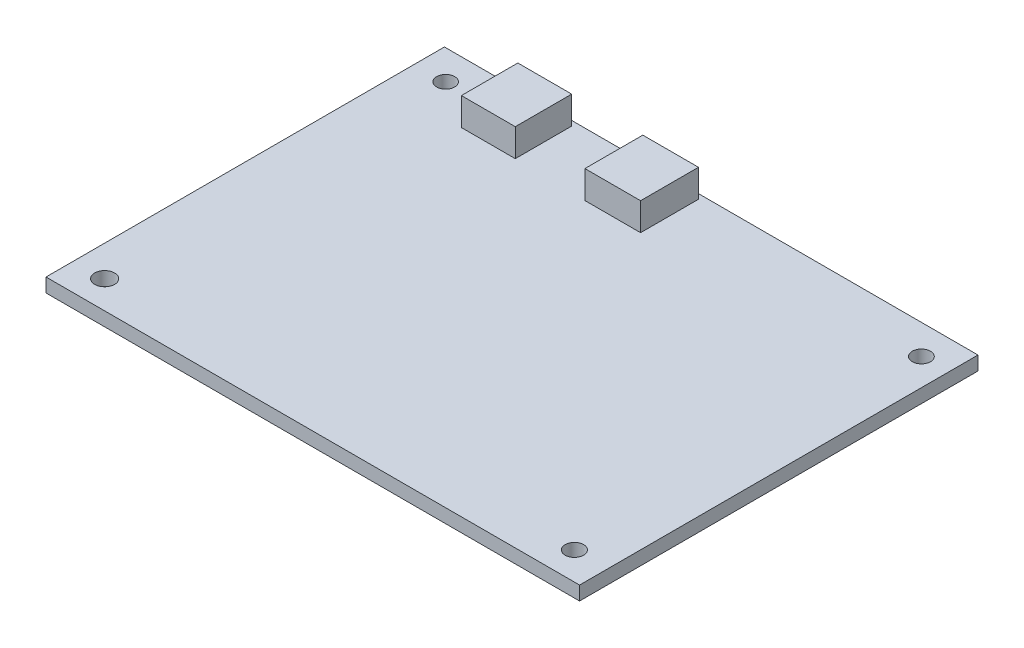
ISO-10303-21;
HEADER;
FILE_DESCRIPTION(('STEP AP214'),'2;1');
FILE_NAME('part.step','',(''),(''),'','','');
FILE_SCHEMA(('AUTOMOTIVE_DESIGN { 1 0 10303 214 1 1 1 1 }'));
ENDSEC;
DATA;
#1=APPLICATION_CONTEXT('core data for automotive mechanical design processes');
#2=APPLICATION_PROTOCOL_DEFINITION('international standard','automotive_design',2000,#1);
#3=PRODUCT_CONTEXT('',#1,'mechanical');
#4=PRODUCT('Part','Part','',(#3));
#5=PRODUCT_RELATED_PRODUCT_CATEGORY('part','',(#4));
#6=PRODUCT_DEFINITION_FORMATION('','',#4);
#7=PRODUCT_DEFINITION_CONTEXT('part definition',#1,'design');
#8=PRODUCT_DEFINITION('design','',#6,#7);
#9=PRODUCT_DEFINITION_SHAPE('','',#8);
#10=(LENGTH_UNIT() NAMED_UNIT(*) SI_UNIT(.MILLI.,.METRE.));
#11=(NAMED_UNIT(*) PLANE_ANGLE_UNIT() SI_UNIT($,.RADIAN.));
#12=(NAMED_UNIT(*) SI_UNIT($,.STERADIAN.) SOLID_ANGLE_UNIT());
#13=UNCERTAINTY_MEASURE_WITH_UNIT(LENGTH_MEASURE(1.E-05),#10,'distance_accuracy_value','');
#14=(GEOMETRIC_REPRESENTATION_CONTEXT(3) GLOBAL_UNCERTAINTY_ASSIGNED_CONTEXT((#13)) GLOBAL_UNIT_ASSIGNED_CONTEXT((#10,
#11,#12)) REPRESENTATION_CONTEXT('',''));
#15=CARTESIAN_POINT('',(0.,0.,0.));
#16=DIRECTION('',(0.,0.,1.));
#17=DIRECTION('',(1.,0.,0.));
#18=AXIS2_PLACEMENT_3D('',#15,#16,#17);
#19=CARTESIAN_POINT('',(0.,2.,0.));
#20=DIRECTION('',(0.,-1.,0.));
#21=DIRECTION('',(0.,0.,-1.));
#22=AXIS2_PLACEMENT_3D('',#19,#20,#21);
#23=PLANE('',#22);
#24=CARTESIAN_POINT('',(34.5985096110648,2.,-24.4852307497467));
#25=DIRECTION('',(0.,1.,0.));
#26=DIRECTION('',(0.,0.,1.));
#27=AXIS2_PLACEMENT_3D('',#24,#25,#26);
#28=CIRCLE('',#27,1.31603448397785);
#29=CARTESIAN_POINT('',(34.5985096110648,2.,-23.1691962657689));
#30=VERTEX_POINT('',#29);
#31=EDGE_CURVE('E631',#30,#30,#28,.T.);
#32=ORIENTED_EDGE('',*,*,#31,.F.);
#33=EDGE_LOOP('',(#32));
#34=FACE_BOUND('',#33,.T.);
#35=CARTESIAN_POINT('',(-34.0582048127804,2.,24.7293266762654));
#36=DIRECTION('',(0.,1.,0.));
#37=DIRECTION('',(0.,0.,1.));
#38=AXIS2_PLACEMENT_3D('',#35,#36,#37);
#39=CIRCLE('',#38,1.43645957947402);
#40=CARTESIAN_POINT('',(-34.0582048127804,2.,26.1657862557394));
#41=VERTEX_POINT('',#40);
#42=EDGE_CURVE('E637',#41,#41,#39,.T.);
#43=ORIENTED_EDGE('',*,*,#42,.F.);
#44=EDGE_LOOP('',(#43));
#45=FACE_BOUND('',#44,.T.);
#46=CARTESIAN_POINT('',(-34.0582048127804,2.,-24.4852307497467));
#47=DIRECTION('',(0.,1.,0.));
#48=DIRECTION('',(0.,0.,1.));
#49=AXIS2_PLACEMENT_3D('',#46,#47,#48);
#50=CIRCLE('',#49,1.3029468687975);
#51=CARTESIAN_POINT('',(-34.0582048127804,2.,-23.1822838809492));
#52=VERTEX_POINT('',#51);
#53=EDGE_CURVE('E695',#52,#52,#50,.T.);
#54=ORIENTED_EDGE('',*,*,#53,.F.);
#55=EDGE_LOOP('',(#54));
#56=FACE_BOUND('',#55,.T.);
#57=CARTESIAN_POINT('',(33.7332280926095,2.,24.7293266762654));
#58=DIRECTION('',(0.,1.,0.));
#59=DIRECTION('',(0.,0.,1.));
#60=AXIS2_PLACEMENT_3D('',#57,#58,#59);
#61=CIRCLE('',#60,1.33131580240961);
#62=CARTESIAN_POINT('',(33.7332280926095,2.,26.060642478675));
#63=VERTEX_POINT('',#62);
#64=EDGE_CURVE('E634',#63,#63,#61,.T.);
#65=ORIENTED_EDGE('',*,*,#64,.F.);
#66=EDGE_LOOP('',(#65));
#67=FACE_BOUND('',#66,.T.);
#68=DIRECTION('',(0.,0.,1.));
#69=VECTOR('',#68,1.);
#70=CARTESIAN_POINT('',(-27.2016642660136,2.,-28.0419154294975));
#71=LINE('',#70,#69);
#72=CARTESIAN_POINT('',(-27.2016642660136,2.,-28.0419154294975));
#73=VERTEX_POINT('',#72);
#74=CARTESIAN_POINT('',(-27.2016642660136,2.,-19.8983175246301));
#75=VERTEX_POINT('',#74);
#76=EDGE_CURVE('E287',#73,#75,#71,.T.);
#77=ORIENTED_EDGE('',*,*,#76,.F.);
#78=DIRECTION('',(-1.,0.,0.));
#79=VECTOR('',#78,1.);
#80=CARTESIAN_POINT('',(-27.2016642660136,2.,-28.0419154294975));
#81=LINE('',#80,#79);
#82=CARTESIAN_POINT('',(-26.2016642660136,2.,-28.0419154294975));
#83=VERTEX_POINT('',#82);
#84=EDGE_CURVE('E307',#83,#73,#81,.T.);
#85=ORIENTED_EDGE('',*,*,#84,.F.);
#86=CARTESIAN_POINT('',(-20.4260844658487,2.,-28.0419154294975));
#87=VERTEX_POINT('',#86);
#88=EDGE_CURVE('E310',#87,#83,#81,.T.);
#89=ORIENTED_EDGE('',*,*,#88,.F.);
#90=CARTESIAN_POINT('',(-19.4260844658487,2.,-28.0419154294975));
#91=VERTEX_POINT('',#90);
#92=EDGE_CURVE('E292',#91,#87,#81,.T.);
#93=ORIENTED_EDGE('',*,*,#92,.F.);
#94=DIRECTION('',(0.,0.,-1.));
#95=VECTOR('',#94,1.);
#96=CARTESIAN_POINT('',(-19.4260844658487,2.,-28.0419154294975));
#97=LINE('',#96,#95);
#98=CARTESIAN_POINT('',(-19.4260844658487,2.,-19.8983175246301));
#99=VERTEX_POINT('',#98);
#100=EDGE_CURVE('E304',#99,#91,#97,.T.);
#101=ORIENTED_EDGE('',*,*,#100,.F.);
#102=DIRECTION('',(1.,0.,0.));
#103=VECTOR('',#102,1.);
#104=CARTESIAN_POINT('',(-27.2016642660136,2.,-19.8983175246301));
#105=LINE('',#104,#103);
#106=EDGE_CURVE('E301',#75,#99,#105,.T.);
#107=ORIENTED_EDGE('',*,*,#106,.F.);
#108=EDGE_LOOP('',(#77,#85,#89,#93,#101,#107));
#109=FACE_BOUND('',#108,.T.);
#110=DIRECTION('',(0.,0.,-1.));
#111=VECTOR('',#110,1.);
#112=CARTESIAN_POINT('',(38.5,2.,28.75));
#113=LINE('',#112,#111);
#114=CARTESIAN_POINT('',(38.5,2.,28.75));
#115=VERTEX_POINT('',#114);
#116=CARTESIAN_POINT('',(38.5,2.,-28.75));
#117=VERTEX_POINT('',#116);
#118=EDGE_CURVE('E323',#115,#117,#113,.T.);
#119=ORIENTED_EDGE('',*,*,#118,.T.);
#120=DIRECTION('',(-1.,0.,0.));
#121=VECTOR('',#120,1.);
#122=CARTESIAN_POINT('',(-38.5,2.,-28.75));
#123=LINE('',#122,#121);
#124=CARTESIAN_POINT('',(-38.5,2.,-28.75));
#125=VERTEX_POINT('',#124);
#126=EDGE_CURVE('E326',#117,#125,#123,.T.);
#127=ORIENTED_EDGE('',*,*,#126,.T.);
#128=DIRECTION('',(0.,0.,1.));
#129=VECTOR('',#128,1.);
#130=CARTESIAN_POINT('',(-38.5,2.,28.75));
#131=LINE('',#130,#129);
#132=CARTESIAN_POINT('',(-38.5,2.,28.75));
#133=VERTEX_POINT('',#132);
#134=EDGE_CURVE('E329',#125,#133,#131,.T.);
#135=ORIENTED_EDGE('',*,*,#134,.T.);
#136=DIRECTION('',(1.,0.,0.));
#137=VECTOR('',#136,1.);
#138=CARTESIAN_POINT('',(-38.5,2.,28.75));
#139=LINE('',#138,#137);
#140=EDGE_CURVE('E331',#133,#115,#139,.T.);
#141=ORIENTED_EDGE('',*,*,#140,.T.);
#142=EDGE_LOOP('',(#119,#127,#135,#141));
#143=FACE_BOUND('',#142,.T.);
#144=DIRECTION('',(0.,0.,1.));
#145=VECTOR('',#144,1.);
#146=CARTESIAN_POINT('',(-9.16586188666458,2.,-28.0453015734762));
#147=LINE('',#146,#145);
#148=CARTESIAN_POINT('',(-9.16586188666458,2.,-28.0453015734762));
#149=VERTEX_POINT('',#148);
#150=CARTESIAN_POINT('',(-9.16586188666457,2.,-19.6883996287313));
#151=VERTEX_POINT('',#150);
#152=EDGE_CURVE('E212',#149,#151,#147,.T.);
#153=ORIENTED_EDGE('',*,*,#152,.F.);
#154=DIRECTION('',(-1.,0.,0.));
#155=VECTOR('',#154,1.);
#156=CARTESIAN_POINT('',(-9.16586188666458,2.,-28.0453015734762));
#157=LINE('',#156,#155);
#158=CARTESIAN_POINT('',(-8.16586188666457,2.,-28.0453015734762));
#159=VERTEX_POINT('',#158);
#160=EDGE_CURVE('E272',#159,#149,#157,.T.);
#161=ORIENTED_EDGE('',*,*,#160,.F.);
#162=CARTESIAN_POINT('',(-2.13398488742122,2.,-28.0453015734762));
#163=VERTEX_POINT('',#162);
#164=EDGE_CURVE('E275',#163,#159,#157,.T.);
#165=ORIENTED_EDGE('',*,*,#164,.F.);
#166=CARTESIAN_POINT('',(-1.13398488742122,2.,-28.0453015734762));
#167=VERTEX_POINT('',#166);
#168=EDGE_CURVE('E257',#167,#163,#157,.T.);
#169=ORIENTED_EDGE('',*,*,#168,.F.);
#170=DIRECTION('',(0.,0.,-1.));
#171=VECTOR('',#170,1.);
#172=CARTESIAN_POINT('',(-1.13398488742122,2.,-28.0453015734762));
#173=LINE('',#172,#171);
#174=CARTESIAN_POINT('',(-1.13398488742122,2.,-19.6883996287313));
#175=VERTEX_POINT('',#174);
#176=EDGE_CURVE('E269',#175,#167,#173,.T.);
#177=ORIENTED_EDGE('',*,*,#176,.F.);
#178=DIRECTION('',(1.,0.,0.));
#179=VECTOR('',#178,1.);
#180=CARTESIAN_POINT('',(-9.16586188666457,2.,-19.6883996287313));
#181=LINE('',#180,#179);
#182=EDGE_CURVE('E266',#151,#175,#181,.T.);
#183=ORIENTED_EDGE('',*,*,#182,.F.);
#184=EDGE_LOOP('',(#153,#161,#165,#169,#177,#183));
#185=FACE_BOUND('',#184,.T.);
#186=ADVANCED_FACE('F33',(#34,#45,#56,#67,#109,#143,#185),#23,.F.);
#187=CARTESIAN_POINT('',(38.5,2.,28.75));
#188=DIRECTION('',(-1.,0.,0.));
#189=DIRECTION('',(0.,0.,1.));
#190=AXIS2_PLACEMENT_3D('',#187,#188,#189);
#191=PLANE('',#190);
#192=DIRECTION('',(0.,0.,-1.));
#193=VECTOR('',#192,1.);
#194=CARTESIAN_POINT('',(38.5,0.,28.75));
#195=LINE('',#194,#193);
#196=CARTESIAN_POINT('',(38.5,0.,28.75));
#197=VERTEX_POINT('',#196);
#198=CARTESIAN_POINT('',(38.5,0.,-28.75));
#199=VERTEX_POINT('',#198);
#200=EDGE_CURVE('E322',#197,#199,#195,.T.);
#201=ORIENTED_EDGE('',*,*,#200,.T.);
#202=DIRECTION('',(0.,-1.,0.));
#203=VECTOR('',#202,1.);
#204=CARTESIAN_POINT('',(38.5,2.,-28.75));
#205=LINE('',#204,#203);
#206=EDGE_CURVE('E11',#117,#199,#205,.T.);
#207=ORIENTED_EDGE('',*,*,#206,.F.);
#208=ORIENTED_EDGE('',*,*,#118,.F.);
#209=DIRECTION('',(0.,-1.,0.));
#210=VECTOR('',#209,1.);
#211=CARTESIAN_POINT('',(38.5,2.,28.75));
#212=LINE('',#211,#210);
#213=EDGE_CURVE('E333',#115,#197,#212,.T.);
#214=ORIENTED_EDGE('',*,*,#213,.T.);
#215=EDGE_LOOP('',(#201,#207,#208,#214));
#216=FACE_BOUND('',#215,.T.);
#217=ADVANCED_FACE('F35',(#216),#191,.F.);
#218=CARTESIAN_POINT('',(-38.5,2.,-28.75));
#219=DIRECTION('',(0.,0.,1.));
#220=DIRECTION('',(1.,0.,0.));
#221=AXIS2_PLACEMENT_3D('',#218,#219,#220);
#222=PLANE('',#221);
#223=DIRECTION('',(-1.,0.,0.));
#224=VECTOR('',#223,1.);
#225=CARTESIAN_POINT('',(-38.5,0.,-28.75));
#226=LINE('',#225,#224);
#227=CARTESIAN_POINT('',(-38.5,0.,-28.75));
#228=VERTEX_POINT('',#227);
#229=EDGE_CURVE('E336',#199,#228,#226,.T.);
#230=ORIENTED_EDGE('',*,*,#229,.T.);
#231=DIRECTION('',(0.,-1.,0.));
#232=VECTOR('',#231,1.);
#233=CARTESIAN_POINT('',(-38.5,2.,-28.75));
#234=LINE('',#233,#232);
#235=EDGE_CURVE('E41',#125,#228,#234,.T.);
#236=ORIENTED_EDGE('',*,*,#235,.F.);
#237=ORIENTED_EDGE('',*,*,#126,.F.);
#238=ORIENTED_EDGE('',*,*,#206,.T.);
#239=EDGE_LOOP('',(#230,#236,#237,#238));
#240=FACE_BOUND('',#239,.T.);
#241=ADVANCED_FACE('F366',(#240),#222,.F.);
#242=CARTESIAN_POINT('',(-38.5,2.,28.75));
#243=DIRECTION('',(1.,0.,0.));
#244=DIRECTION('',(0.,0.,-1.));
#245=AXIS2_PLACEMENT_3D('',#242,#243,#244);
#246=PLANE('',#245);
#247=DIRECTION('',(0.,0.,1.));
#248=VECTOR('',#247,1.);
#249=CARTESIAN_POINT('',(-38.5,0.,28.75));
#250=LINE('',#249,#248);
#251=CARTESIAN_POINT('',(-38.5,0.,28.75));
#252=VERTEX_POINT('',#251);
#253=EDGE_CURVE('E338',#228,#252,#250,.T.);
#254=ORIENTED_EDGE('',*,*,#253,.T.);
#255=DIRECTION('',(0.,-1.,0.));
#256=VECTOR('',#255,1.);
#257=CARTESIAN_POINT('',(-38.5,2.,28.75));
#258=LINE('',#257,#256);
#259=EDGE_CURVE('E343',#133,#252,#258,.T.);
#260=ORIENTED_EDGE('',*,*,#259,.F.);
#261=ORIENTED_EDGE('',*,*,#134,.F.);
#262=ORIENTED_EDGE('',*,*,#235,.T.);
#263=EDGE_LOOP('',(#254,#260,#261,#262));
#264=FACE_BOUND('',#263,.T.);
#265=ADVANCED_FACE('F350',(#264),#246,.F.);
#266=CARTESIAN_POINT('',(-38.5,2.,28.75));
#267=DIRECTION('',(0.,0.,-1.));
#268=DIRECTION('',(-1.,0.,0.));
#269=AXIS2_PLACEMENT_3D('',#266,#267,#268);
#270=PLANE('',#269);
#271=DIRECTION('',(1.,0.,0.));
#272=VECTOR('',#271,1.);
#273=CARTESIAN_POINT('',(-38.5,0.,28.75));
#274=LINE('',#273,#272);
#275=EDGE_CURVE('E327',#252,#197,#274,.T.);
#276=ORIENTED_EDGE('',*,*,#275,.T.);
#277=ORIENTED_EDGE('',*,*,#213,.F.);
#278=ORIENTED_EDGE('',*,*,#140,.F.);
#279=ORIENTED_EDGE('',*,*,#259,.T.);
#280=EDGE_LOOP('',(#276,#277,#278,#279));
#281=FACE_BOUND('',#280,.T.);
#282=ADVANCED_FACE('F359',(#281),#270,.F.);
#283=CARTESIAN_POINT('',(0.,0.,0.));
#284=DIRECTION('',(0.,-1.,0.));
#285=DIRECTION('',(0.,0.,-1.));
#286=AXIS2_PLACEMENT_3D('',#283,#284,#285);
#287=PLANE('',#286);
#288=CARTESIAN_POINT('',(34.5985096110648,0.,-24.4852307497467));
#289=DIRECTION('',(0.,1.,0.));
#290=DIRECTION('',(0.,0.,1.));
#291=AXIS2_PLACEMENT_3D('',#288,#289,#290);
#292=CIRCLE('',#291,1.31603448397785);
#293=CARTESIAN_POINT('',(34.5985096110648,0.,-23.1691962657689));
#294=VERTEX_POINT('',#293);
#295=EDGE_CURVE('E629',#294,#294,#292,.T.);
#296=ORIENTED_EDGE('',*,*,#295,.T.);
#297=EDGE_LOOP('',(#296));
#298=FACE_BOUND('',#297,.T.);
#299=CARTESIAN_POINT('',(-34.0582048127804,0.,24.7293266762654));
#300=DIRECTION('',(0.,1.,0.));
#301=DIRECTION('',(0.,0.,1.));
#302=AXIS2_PLACEMENT_3D('',#299,#300,#301);
#303=CIRCLE('',#302,1.43645957947402);
#304=CARTESIAN_POINT('',(-34.0582048127804,0.,26.1657862557394));
#305=VERTEX_POINT('',#304);
#306=EDGE_CURVE('E632',#305,#305,#303,.T.);
#307=ORIENTED_EDGE('',*,*,#306,.T.);
#308=EDGE_LOOP('',(#307));
#309=FACE_BOUND('',#308,.T.);
#310=CARTESIAN_POINT('',(-34.0582048127804,0.,-24.4852307497467));
#311=DIRECTION('',(0.,1.,0.));
#312=DIRECTION('',(0.,0.,1.));
#313=AXIS2_PLACEMENT_3D('',#310,#311,#312);
#314=CIRCLE('',#313,1.3029468687975);
#315=CARTESIAN_POINT('',(-34.0582048127804,0.,-23.1822838809492));
#316=VERTEX_POINT('',#315);
#317=EDGE_CURVE('E643',#316,#316,#314,.T.);
#318=ORIENTED_EDGE('',*,*,#317,.T.);
#319=EDGE_LOOP('',(#318));
#320=FACE_BOUND('',#319,.T.);
#321=CARTESIAN_POINT('',(33.7332280926095,0.,24.7293266762654));
#322=DIRECTION('',(0.,1.,0.));
#323=DIRECTION('',(0.,0.,1.));
#324=AXIS2_PLACEMENT_3D('',#321,#322,#323);
#325=CIRCLE('',#324,1.33131580240961);
#326=CARTESIAN_POINT('',(33.7332280926095,0.,26.060642478675));
#327=VERTEX_POINT('',#326);
#328=EDGE_CURVE('E644',#327,#327,#325,.T.);
#329=ORIENTED_EDGE('',*,*,#328,.T.);
#330=EDGE_LOOP('',(#329));
#331=FACE_BOUND('',#330,.T.);
#332=ORIENTED_EDGE('',*,*,#200,.F.);
#333=ORIENTED_EDGE('',*,*,#275,.F.);
#334=ORIENTED_EDGE('',*,*,#253,.F.);
#335=ORIENTED_EDGE('',*,*,#229,.F.);
#336=EDGE_LOOP('',(#332,#333,#334,#335));
#337=FACE_BOUND('',#336,.T.);
#338=ADVANCED_FACE('F356',(#298,#309,#320,#331,#337),#287,.T.);
#339=CARTESIAN_POINT('',(-27.2016642660136,6.,-28.0419154294975));
#340=DIRECTION('',(1.,0.,0.));
#341=DIRECTION('',(0.,0.,-1.));
#342=AXIS2_PLACEMENT_3D('',#339,#340,#341);
#343=PLANE('',#342);
#344=ORIENTED_EDGE('',*,*,#76,.T.);
#345=DIRECTION('',(0.,-1.,0.));
#346=VECTOR('',#345,1.);
#347=CARTESIAN_POINT('',(-27.2016642660136,6.,-19.8983175246301));
#348=LINE('',#347,#346);
#349=CARTESIAN_POINT('',(-27.2016642660136,6.,-19.8983175246301));
#350=VERTEX_POINT('',#349);
#351=EDGE_CURVE('E319',#350,#75,#348,.T.);
#352=ORIENTED_EDGE('',*,*,#351,.F.);
#353=DIRECTION('',(0.,0.,1.));
#354=VECTOR('',#353,1.);
#355=CARTESIAN_POINT('',(-27.2016642660136,6.,-28.0419154294975));
#356=LINE('',#355,#354);
#357=CARTESIAN_POINT('',(-27.2016642660136,6.,-28.0419154294975));
#358=VERTEX_POINT('',#357);
#359=EDGE_CURVE('E288',#358,#350,#356,.T.);
#360=ORIENTED_EDGE('',*,*,#359,.F.);
#361=DIRECTION('',(0.,-1.,0.));
#362=VECTOR('',#361,1.);
#363=CARTESIAN_POINT('',(-27.2016642660136,6.,-28.0419154294975));
#364=LINE('',#363,#362);
#365=EDGE_CURVE('E298',#358,#73,#364,.T.);
#366=ORIENTED_EDGE('',*,*,#365,.T.);
#367=EDGE_LOOP('',(#344,#352,#360,#366));
#368=FACE_BOUND('',#367,.T.);
#369=ADVANCED_FACE('F384',(#368),#343,.F.);
#370=CARTESIAN_POINT('',(-27.2016642660136,6.,-19.8983175246301));
#371=DIRECTION('',(0.,0.,-1.));
#372=DIRECTION('',(-1.,0.,0.));
#373=AXIS2_PLACEMENT_3D('',#370,#371,#372);
#374=PLANE('',#373);
#375=ORIENTED_EDGE('',*,*,#106,.T.);
#376=DIRECTION('',(0.,-1.,0.));
#377=VECTOR('',#376,1.);
#378=CARTESIAN_POINT('',(-19.4260844658487,6.,-19.8983175246301));
#379=LINE('',#378,#377);
#380=CARTESIAN_POINT('',(-19.4260844658487,6.,-19.8983175246301));
#381=VERTEX_POINT('',#380);
#382=EDGE_CURVE('E316',#381,#99,#379,.T.);
#383=ORIENTED_EDGE('',*,*,#382,.F.);
#384=DIRECTION('',(1.,0.,0.));
#385=VECTOR('',#384,1.);
#386=CARTESIAN_POINT('',(-27.2016642660136,6.,-19.8983175246301));
#387=LINE('',#386,#385);
#388=EDGE_CURVE('E291',#350,#381,#387,.T.);
#389=ORIENTED_EDGE('',*,*,#388,.F.);
#390=ORIENTED_EDGE('',*,*,#351,.T.);
#391=EDGE_LOOP('',(#375,#383,#389,#390));
#392=FACE_BOUND('',#391,.T.);
#393=ADVANCED_FACE('F431',(#392),#374,.F.);
#394=CARTESIAN_POINT('',(-19.4260844658487,6.,-28.0419154294975));
#395=DIRECTION('',(-1.,0.,0.));
#396=DIRECTION('',(0.,0.,1.));
#397=AXIS2_PLACEMENT_3D('',#394,#395,#396);
#398=PLANE('',#397);
#399=ORIENTED_EDGE('',*,*,#100,.T.);
#400=DIRECTION('',(0.,-1.,0.));
#401=VECTOR('',#400,1.);
#402=CARTESIAN_POINT('',(-19.4260844658487,6.,-28.0419154294975));
#403=LINE('',#402,#401);
#404=CARTESIAN_POINT('',(-19.4260844658487,6.,-28.0419154294975));
#405=VERTEX_POINT('',#404);
#406=EDGE_CURVE('E313',#405,#91,#403,.T.);
#407=ORIENTED_EDGE('',*,*,#406,.F.);
#408=DIRECTION('',(0.,0.,-1.));
#409=VECTOR('',#408,1.);
#410=CARTESIAN_POINT('',(-19.4260844658487,6.,-28.0419154294975));
#411=LINE('',#410,#409);
#412=EDGE_CURVE('E294',#381,#405,#411,.T.);
#413=ORIENTED_EDGE('',*,*,#412,.F.);
#414=ORIENTED_EDGE('',*,*,#382,.T.);
#415=EDGE_LOOP('',(#399,#407,#413,#414));
#416=FACE_BOUND('',#415,.T.);
#417=ADVANCED_FACE('F437',(#416),#398,.F.);
#418=CARTESIAN_POINT('',(-27.2016642660136,6.,-28.0419154294975));
#419=DIRECTION('',(0.,0.,1.));
#420=DIRECTION('',(1.,0.,0.));
#421=AXIS2_PLACEMENT_3D('',#418,#419,#420);
#422=PLANE('',#421);
#423=DIRECTION('',(-1.,0.,0.));
#424=VECTOR('',#423,1.);
#425=CARTESIAN_POINT('',(-27.2016642660136,5.,-28.0419154294975));
#426=LINE('',#425,#424);
#427=CARTESIAN_POINT('',(-20.4260844658487,5.,-28.0419154294975));
#428=VERTEX_POINT('',#427);
#429=CARTESIAN_POINT('',(-26.2016642660136,5.,-28.0419154294975));
#430=VERTEX_POINT('',#429);
#431=EDGE_CURVE('E48',#428,#430,#426,.T.);
#432=ORIENTED_EDGE('',*,*,#431,.T.);
#433=DIRECTION('',(0.,-1.,0.));
#434=VECTOR('',#433,1.);
#435=CARTESIAN_POINT('',(-26.2016642660136,6.,-28.0419154294975));
#436=LINE('',#435,#434);
#437=EDGE_CURVE('E237',#430,#83,#436,.T.);
#438=ORIENTED_EDGE('',*,*,#437,.T.);
#439=ORIENTED_EDGE('',*,*,#84,.T.);
#440=ORIENTED_EDGE('',*,*,#365,.F.);
#441=DIRECTION('',(-1.,0.,0.));
#442=VECTOR('',#441,1.);
#443=CARTESIAN_POINT('',(-27.2016642660136,6.,-28.0419154294975));
#444=LINE('',#443,#442);
#445=EDGE_CURVE('E296',#405,#358,#444,.T.);
#446=ORIENTED_EDGE('',*,*,#445,.F.);
#447=ORIENTED_EDGE('',*,*,#406,.T.);
#448=ORIENTED_EDGE('',*,*,#92,.T.);
#449=DIRECTION('',(0.,-1.,0.));
#450=VECTOR('',#449,1.);
#451=CARTESIAN_POINT('',(-20.4260844658487,6.,-28.0419154294975));
#452=LINE('',#451,#450);
#453=EDGE_CURVE('E210',#428,#87,#452,.T.);
#454=ORIENTED_EDGE('',*,*,#453,.F.);
#455=EDGE_LOOP('',(#432,#438,#439,#440,#446,#447,#448,#454));
#456=FACE_BOUND('',#455,.T.);
#457=ADVANCED_FACE('F444',(#456),#422,.F.);
#458=CARTESIAN_POINT('',(0.,6.,0.));
#459=DIRECTION('',(0.,1.,0.));
#460=DIRECTION('',(0.,0.,1.));
#461=AXIS2_PLACEMENT_3D('',#458,#459,#460);
#462=PLANE('',#461);
#463=ORIENTED_EDGE('',*,*,#359,.T.);
#464=ORIENTED_EDGE('',*,*,#388,.T.);
#465=ORIENTED_EDGE('',*,*,#412,.T.);
#466=ORIENTED_EDGE('',*,*,#445,.T.);
#467=EDGE_LOOP('',(#463,#464,#465,#466));
#468=FACE_BOUND('',#467,.T.);
#469=ADVANCED_FACE('F453',(#468),#462,.T.);
#470=CARTESIAN_POINT('',(-9.16586188666458,6.,-28.0453015734762));
#471=DIRECTION('',(1.,0.,0.));
#472=DIRECTION('',(0.,0.,-1.));
#473=AXIS2_PLACEMENT_3D('',#470,#471,#472);
#474=PLANE('',#473);
#475=ORIENTED_EDGE('',*,*,#152,.T.);
#476=DIRECTION('',(0.,-1.,0.));
#477=VECTOR('',#476,1.);
#478=CARTESIAN_POINT('',(-9.16586188666457,6.,-19.6883996287313));
#479=LINE('',#478,#477);
#480=CARTESIAN_POINT('',(-9.16586188666457,6.,-19.6883996287313));
#481=VERTEX_POINT('',#480);
#482=EDGE_CURVE('E284',#481,#151,#479,.T.);
#483=ORIENTED_EDGE('',*,*,#482,.F.);
#484=DIRECTION('',(0.,0.,1.));
#485=VECTOR('',#484,1.);
#486=CARTESIAN_POINT('',(-9.16586188666458,6.,-28.0453015734762));
#487=LINE('',#486,#485);
#488=CARTESIAN_POINT('',(-9.16586188666458,6.,-28.0453015734762));
#489=VERTEX_POINT('',#488);
#490=EDGE_CURVE('E253',#489,#481,#487,.T.);
#491=ORIENTED_EDGE('',*,*,#490,.F.);
#492=DIRECTION('',(0.,-1.,0.));
#493=VECTOR('',#492,1.);
#494=CARTESIAN_POINT('',(-9.16586188666458,6.,-28.0453015734762));
#495=LINE('',#494,#493);
#496=EDGE_CURVE('E263',#489,#149,#495,.T.);
#497=ORIENTED_EDGE('',*,*,#496,.T.);
#498=EDGE_LOOP('',(#475,#483,#491,#497));
#499=FACE_BOUND('',#498,.T.);
#500=ADVANCED_FACE('F462',(#499),#474,.F.);
#501=CARTESIAN_POINT('',(-9.16586188666457,6.,-19.6883996287313));
#502=DIRECTION('',(0.,0.,-1.));
#503=DIRECTION('',(-1.,0.,0.));
#504=AXIS2_PLACEMENT_3D('',#501,#502,#503);
#505=PLANE('',#504);
#506=ORIENTED_EDGE('',*,*,#182,.T.);
#507=DIRECTION('',(0.,-1.,0.));
#508=VECTOR('',#507,1.);
#509=CARTESIAN_POINT('',(-1.13398488742122,6.,-19.6883996287313));
#510=LINE('',#509,#508);
#511=CARTESIAN_POINT('',(-1.13398488742122,6.,-19.6883996287313));
#512=VERTEX_POINT('',#511);
#513=EDGE_CURVE('E281',#512,#175,#510,.T.);
#514=ORIENTED_EDGE('',*,*,#513,.F.);
#515=DIRECTION('',(1.,0.,0.));
#516=VECTOR('',#515,1.);
#517=CARTESIAN_POINT('',(-9.16586188666457,6.,-19.6883996287313));
#518=LINE('',#517,#516);
#519=EDGE_CURVE('E256',#481,#512,#518,.T.);
#520=ORIENTED_EDGE('',*,*,#519,.F.);
#521=ORIENTED_EDGE('',*,*,#482,.T.);
#522=EDGE_LOOP('',(#506,#514,#520,#521));
#523=FACE_BOUND('',#522,.T.);
#524=ADVANCED_FACE('F470',(#523),#505,.F.);
#525=CARTESIAN_POINT('',(-1.13398488742122,6.,-28.0453015734762));
#526=DIRECTION('',(-1.,0.,0.));
#527=DIRECTION('',(0.,0.,1.));
#528=AXIS2_PLACEMENT_3D('',#525,#526,#527);
#529=PLANE('',#528);
#530=ORIENTED_EDGE('',*,*,#176,.T.);
#531=DIRECTION('',(0.,-1.,0.));
#532=VECTOR('',#531,1.);
#533=CARTESIAN_POINT('',(-1.13398488742122,6.,-28.0453015734762));
#534=LINE('',#533,#532);
#535=CARTESIAN_POINT('',(-1.13398488742122,6.,-28.0453015734762));
#536=VERTEX_POINT('',#535);
#537=EDGE_CURVE('E278',#536,#167,#534,.T.);
#538=ORIENTED_EDGE('',*,*,#537,.F.);
#539=DIRECTION('',(0.,0.,-1.));
#540=VECTOR('',#539,1.);
#541=CARTESIAN_POINT('',(-1.13398488742122,6.,-28.0453015734762));
#542=LINE('',#541,#540);
#543=EDGE_CURVE('E259',#512,#536,#542,.T.);
#544=ORIENTED_EDGE('',*,*,#543,.F.);
#545=ORIENTED_EDGE('',*,*,#513,.T.);
#546=EDGE_LOOP('',(#530,#538,#544,#545));
#547=FACE_BOUND('',#546,.T.);
#548=ADVANCED_FACE('F478',(#547),#529,.F.);
#549=CARTESIAN_POINT('',(-9.16586188666458,6.,-28.0453015734762));
#550=DIRECTION('',(0.,0.,1.));
#551=DIRECTION('',(1.,0.,0.));
#552=AXIS2_PLACEMENT_3D('',#549,#550,#551);
#553=PLANE('',#552);
#554=DIRECTION('',(-1.,0.,0.));
#555=VECTOR('',#554,1.);
#556=CARTESIAN_POINT('',(-9.16586188666458,5.,-28.0453015734762));
#557=LINE('',#556,#555);
#558=CARTESIAN_POINT('',(-2.13398488742122,5.,-28.0453015734762));
#559=VERTEX_POINT('',#558);
#560=CARTESIAN_POINT('',(-8.16586188666457,5.,-28.0453015734762));
#561=VERTEX_POINT('',#560);
#562=EDGE_CURVE('E56',#559,#561,#557,.T.);
#563=ORIENTED_EDGE('',*,*,#562,.T.);
#564=DIRECTION('',(0.,-1.,0.));
#565=VECTOR('',#564,1.);
#566=CARTESIAN_POINT('',(-8.16586188666457,6.,-28.0453015734762));
#567=LINE('',#566,#565);
#568=EDGE_CURVE('E245',#561,#159,#567,.T.);
#569=ORIENTED_EDGE('',*,*,#568,.T.);
#570=ORIENTED_EDGE('',*,*,#160,.T.);
#571=ORIENTED_EDGE('',*,*,#496,.F.);
#572=DIRECTION('',(-1.,0.,0.));
#573=VECTOR('',#572,1.);
#574=CARTESIAN_POINT('',(-9.16586188666458,6.,-28.0453015734762));
#575=LINE('',#574,#573);
#576=EDGE_CURVE('E261',#536,#489,#575,.T.);
#577=ORIENTED_EDGE('',*,*,#576,.F.);
#578=ORIENTED_EDGE('',*,*,#537,.T.);
#579=ORIENTED_EDGE('',*,*,#168,.T.);
#580=DIRECTION('',(0.,-1.,0.));
#581=VECTOR('',#580,1.);
#582=CARTESIAN_POINT('',(-2.13398488742122,6.,-28.0453015734762));
#583=LINE('',#582,#581);
#584=EDGE_CURVE('E232',#559,#163,#583,.T.);
#585=ORIENTED_EDGE('',*,*,#584,.F.);
#586=EDGE_LOOP('',(#563,#569,#570,#571,#577,#578,#579,#585));
#587=FACE_BOUND('',#586,.T.);
#588=ADVANCED_FACE('F486',(#587),#553,.F.);
#589=CARTESIAN_POINT('',(0.,6.,0.));
#590=DIRECTION('',(0.,1.,0.));
#591=DIRECTION('',(0.,0.,1.));
#592=AXIS2_PLACEMENT_3D('',#589,#590,#591);
#593=PLANE('',#592);
#594=ORIENTED_EDGE('',*,*,#490,.T.);
#595=ORIENTED_EDGE('',*,*,#519,.T.);
#596=ORIENTED_EDGE('',*,*,#543,.T.);
#597=ORIENTED_EDGE('',*,*,#576,.T.);
#598=EDGE_LOOP('',(#594,#595,#596,#597));
#599=FACE_BOUND('',#598,.T.);
#600=ADVANCED_FACE('F493',(#599),#593,.T.);
#601=CARTESIAN_POINT('',(-9.16586188666458,6.,-28.0453015734762));
#602=DIRECTION('',(0.,0.,1.));
#603=DIRECTION('',(1.,0.,0.));
#604=AXIS2_PLACEMENT_3D('',#601,#602,#603);
#605=PLANE('',#604);
#606=ORIENTED_EDGE('',*,*,#164,.T.);
#607=CARTESIAN_POINT('',(-8.16586188666457,1.,-28.0453015734762));
#608=VERTEX_POINT('',#607);
#609=EDGE_CURVE('E249',#159,#608,#567,.T.);
#610=ORIENTED_EDGE('',*,*,#609,.T.);
#611=DIRECTION('',(-1.,0.,0.));
#612=VECTOR('',#611,1.);
#613=CARTESIAN_POINT('',(0.,1.,-28.0453015734762));
#614=LINE('',#613,#612);
#615=CARTESIAN_POINT('',(-2.13398488742122,1.,-28.0453015734762));
#616=VERTEX_POINT('',#615);
#617=EDGE_CURVE('E229',#616,#608,#614,.T.);
#618=ORIENTED_EDGE('',*,*,#617,.F.);
#619=EDGE_CURVE('E248',#163,#616,#583,.T.);
#620=ORIENTED_EDGE('',*,*,#619,.F.);
#621=EDGE_LOOP('',(#606,#610,#618,#620));
#622=FACE_BOUND('',#621,.T.);
#623=ADVANCED_FACE('F415',(#622),#605,.T.);
#624=CARTESIAN_POINT('',(0.,1.,0.));
#625=DIRECTION('',(0.,-1.,0.));
#626=DIRECTION('',(0.,0.,-1.));
#627=AXIS2_PLACEMENT_3D('',#624,#625,#626);
#628=PLANE('',#627);
#629=DIRECTION('',(1.,0.,0.));
#630=VECTOR('',#629,1.);
#631=CARTESIAN_POINT('',(0.,1.,-20.6883996287313));
#632=LINE('',#631,#630);
#633=CARTESIAN_POINT('',(-8.16586188666457,1.,-20.6883996287313));
#634=VERTEX_POINT('',#633);
#635=CARTESIAN_POINT('',(-2.13398488742122,1.,-20.6883996287313));
#636=VERTEX_POINT('',#635);
#637=EDGE_CURVE('E652',#634,#636,#632,.T.);
#638=ORIENTED_EDGE('',*,*,#637,.T.);
#639=DIRECTION('',(0.,0.,-1.));
#640=VECTOR('',#639,1.);
#641=CARTESIAN_POINT('',(-2.13398488742122,1.,0.));
#642=LINE('',#641,#640);
#643=EDGE_CURVE('E244',#636,#616,#642,.T.);
#644=ORIENTED_EDGE('',*,*,#643,.T.);
#645=ORIENTED_EDGE('',*,*,#617,.T.);
#646=DIRECTION('',(0.,0.,1.));
#647=VECTOR('',#646,1.);
#648=CARTESIAN_POINT('',(-8.16586188666457,1.,0.));
#649=LINE('',#648,#647);
#650=EDGE_CURVE('E647',#608,#634,#649,.T.);
#651=ORIENTED_EDGE('',*,*,#650,.T.);
#652=EDGE_LOOP('',(#638,#644,#645,#651));
#653=FACE_BOUND('',#652,.T.);
#654=ADVANCED_FACE('F409',(#653),#628,.F.);
#655=CARTESIAN_POINT('',(-8.16586188666457,6.,-28.0453015734762));
#656=DIRECTION('',(1.,0.,0.));
#657=DIRECTION('',(0.,0.,-1.));
#658=AXIS2_PLACEMENT_3D('',#655,#656,#657);
#659=PLANE('',#658);
#660=ORIENTED_EDGE('',*,*,#650,.F.);
#661=ORIENTED_EDGE('',*,*,#609,.F.);
#662=ORIENTED_EDGE('',*,*,#568,.F.);
#663=DIRECTION('',(0.,0.,1.));
#664=VECTOR('',#663,1.);
#665=CARTESIAN_POINT('',(-8.16586188666457,5.,-28.0453015734762));
#666=LINE('',#665,#664);
#667=CARTESIAN_POINT('',(-8.16586188666457,5.,-20.6883996287313));
#668=VERTEX_POINT('',#667);
#669=EDGE_CURVE('E225',#561,#668,#666,.T.);
#670=ORIENTED_EDGE('',*,*,#669,.T.);
#671=DIRECTION('',(0.,-1.,0.));
#672=VECTOR('',#671,1.);
#673=CARTESIAN_POINT('',(-8.16586188666457,6.,-20.6883996287313));
#674=LINE('',#673,#672);
#675=EDGE_CURVE('E221',#668,#634,#674,.T.);
#676=ORIENTED_EDGE('',*,*,#675,.T.);
#677=EDGE_LOOP('',(#660,#661,#662,#670,#676));
#678=FACE_BOUND('',#677,.T.);
#679=ADVANCED_FACE('F414',(#678),#659,.T.);
#680=CARTESIAN_POINT('',(-9.16586188666457,6.,-20.6883996287313));
#681=DIRECTION('',(0.,0.,-1.));
#682=DIRECTION('',(-1.,0.,0.));
#683=AXIS2_PLACEMENT_3D('',#680,#681,#682);
#684=PLANE('',#683);
#685=ORIENTED_EDGE('',*,*,#637,.F.);
#686=ORIENTED_EDGE('',*,*,#675,.F.);
#687=DIRECTION('',(1.,0.,0.));
#688=VECTOR('',#687,1.);
#689=CARTESIAN_POINT('',(-9.16586188666457,5.,-20.6883996287313));
#690=LINE('',#689,#688);
#691=CARTESIAN_POINT('',(-2.13398488742122,5.,-20.6883996287313));
#692=VERTEX_POINT('',#691);
#693=EDGE_CURVE('E228',#668,#692,#690,.T.);
#694=ORIENTED_EDGE('',*,*,#693,.T.);
#695=DIRECTION('',(0.,-1.,0.));
#696=VECTOR('',#695,1.);
#697=CARTESIAN_POINT('',(-2.13398488742122,6.,-20.6883996287313));
#698=LINE('',#697,#696);
#699=EDGE_CURVE('E224',#692,#636,#698,.T.);
#700=ORIENTED_EDGE('',*,*,#699,.T.);
#701=EDGE_LOOP('',(#685,#686,#694,#700));
#702=FACE_BOUND('',#701,.T.);
#703=ADVANCED_FACE('F514',(#702),#684,.T.);
#704=CARTESIAN_POINT('',(-2.13398488742122,6.,-28.0453015734762));
#705=DIRECTION('',(-1.,0.,0.));
#706=DIRECTION('',(0.,0.,1.));
#707=AXIS2_PLACEMENT_3D('',#704,#705,#706);
#708=PLANE('',#707);
#709=ORIENTED_EDGE('',*,*,#643,.F.);
#710=ORIENTED_EDGE('',*,*,#699,.F.);
#711=DIRECTION('',(0.,0.,-1.));
#712=VECTOR('',#711,1.);
#713=CARTESIAN_POINT('',(-2.13398488742122,5.,-28.0453015734762));
#714=LINE('',#713,#712);
#715=EDGE_CURVE('E234',#692,#559,#714,.T.);
#716=ORIENTED_EDGE('',*,*,#715,.T.);
#717=ORIENTED_EDGE('',*,*,#584,.T.);
#718=ORIENTED_EDGE('',*,*,#619,.T.);
#719=EDGE_LOOP('',(#709,#710,#716,#717,#718));
#720=FACE_BOUND('',#719,.T.);
#721=ADVANCED_FACE('F522',(#720),#708,.T.);
#722=CARTESIAN_POINT('',(0.,5.,0.));
#723=DIRECTION('',(0.,1.,0.));
#724=DIRECTION('',(0.,0.,1.));
#725=AXIS2_PLACEMENT_3D('',#722,#723,#724);
#726=PLANE('',#725);
#727=ORIENTED_EDGE('',*,*,#669,.F.);
#728=ORIENTED_EDGE('',*,*,#562,.F.);
#729=ORIENTED_EDGE('',*,*,#715,.F.);
#730=ORIENTED_EDGE('',*,*,#693,.F.);
#731=EDGE_LOOP('',(#727,#728,#729,#730));
#732=FACE_BOUND('',#731,.T.);
#733=ADVANCED_FACE('F530',(#732),#726,.F.);
#734=CARTESIAN_POINT('',(-27.2016642660136,6.,-28.0419154294975));
#735=DIRECTION('',(0.,0.,1.));
#736=DIRECTION('',(1.,0.,0.));
#737=AXIS2_PLACEMENT_3D('',#734,#735,#736);
#738=PLANE('',#737);
#739=ORIENTED_EDGE('',*,*,#88,.T.);
#740=CARTESIAN_POINT('',(-26.2016642660136,1.,-28.0419154294975));
#741=VERTEX_POINT('',#740);
#742=EDGE_CURVE('E240',#83,#741,#436,.T.);
#743=ORIENTED_EDGE('',*,*,#742,.T.);
#744=DIRECTION('',(-1.,0.,0.));
#745=VECTOR('',#744,1.);
#746=CARTESIAN_POINT('',(0.,1.,-28.0419154294975));
#747=LINE('',#746,#745);
#748=CARTESIAN_POINT('',(-20.4260844658487,1.,-28.0419154294975));
#749=VERTEX_POINT('',#748);
#750=EDGE_CURVE('E196',#749,#741,#747,.T.);
#751=ORIENTED_EDGE('',*,*,#750,.F.);
#752=EDGE_CURVE('E192',#87,#749,#452,.T.);
#753=ORIENTED_EDGE('',*,*,#752,.F.);
#754=EDGE_LOOP('',(#739,#743,#751,#753));
#755=FACE_BOUND('',#754,.T.);
#756=ADVANCED_FACE('F538',(#755),#738,.T.);
#757=CARTESIAN_POINT('',(0.,5.,0.));
#758=DIRECTION('',(0.,1.,0.));
#759=DIRECTION('',(0.,0.,1.));
#760=AXIS2_PLACEMENT_3D('',#757,#758,#759);
#761=PLANE('',#760);
#762=DIRECTION('',(0.,0.,1.));
#763=VECTOR('',#762,1.);
#764=CARTESIAN_POINT('',(-26.2016642660136,5.,-28.0419154294975));
#765=LINE('',#764,#763);
#766=CARTESIAN_POINT('',(-26.2016642660136,5.,-20.8983175246301));
#767=VERTEX_POINT('',#766);
#768=EDGE_CURVE('E217',#430,#767,#765,.T.);
#769=ORIENTED_EDGE('',*,*,#768,.F.);
#770=ORIENTED_EDGE('',*,*,#431,.F.);
#771=DIRECTION('',(0.,0.,-1.));
#772=VECTOR('',#771,1.);
#773=CARTESIAN_POINT('',(-20.4260844658487,5.,-28.0419154294975));
#774=LINE('',#773,#772);
#775=CARTESIAN_POINT('',(-20.4260844658487,5.,-20.8983175246301));
#776=VERTEX_POINT('',#775);
#777=EDGE_CURVE('E219',#776,#428,#774,.T.);
#778=ORIENTED_EDGE('',*,*,#777,.F.);
#779=DIRECTION('',(1.,0.,0.));
#780=VECTOR('',#779,1.);
#781=CARTESIAN_POINT('',(-27.2016642660136,5.,-20.8983175246301));
#782=LINE('',#781,#780);
#783=EDGE_CURVE('E208',#767,#776,#782,.T.);
#784=ORIENTED_EDGE('',*,*,#783,.F.);
#785=EDGE_LOOP('',(#769,#770,#778,#784));
#786=FACE_BOUND('',#785,.T.);
#787=ADVANCED_FACE('F545',(#786),#761,.F.);
#788=CARTESIAN_POINT('',(-20.4260844658487,6.,-28.0419154294975));
#789=DIRECTION('',(-1.,0.,0.));
#790=DIRECTION('',(0.,0.,1.));
#791=AXIS2_PLACEMENT_3D('',#788,#789,#790);
#792=PLANE('',#791);
#793=DIRECTION('',(0.,0.,-1.));
#794=VECTOR('',#793,1.);
#795=CARTESIAN_POINT('',(-20.4260844658487,1.,0.));
#796=LINE('',#795,#794);
#797=CARTESIAN_POINT('',(-20.4260844658487,1.,-20.8983175246301));
#798=VERTEX_POINT('',#797);
#799=EDGE_CURVE('E186',#798,#749,#796,.T.);
#800=ORIENTED_EDGE('',*,*,#799,.F.);
#801=DIRECTION('',(0.,-1.,0.));
#802=VECTOR('',#801,1.);
#803=CARTESIAN_POINT('',(-20.4260844658487,6.,-20.8983175246301));
#804=LINE('',#803,#802);
#805=EDGE_CURVE('E190',#776,#798,#804,.T.);
#806=ORIENTED_EDGE('',*,*,#805,.F.);
#807=ORIENTED_EDGE('',*,*,#777,.T.);
#808=ORIENTED_EDGE('',*,*,#453,.T.);
#809=ORIENTED_EDGE('',*,*,#752,.T.);
#810=EDGE_LOOP('',(#800,#806,#807,#808,#809));
#811=FACE_BOUND('',#810,.T.);
#812=ADVANCED_FACE('F188',(#811),#792,.T.);
#813=CARTESIAN_POINT('',(-27.2016642660136,6.,-20.8983175246301));
#814=DIRECTION('',(0.,0.,-1.));
#815=DIRECTION('',(-1.,0.,0.));
#816=AXIS2_PLACEMENT_3D('',#813,#814,#815);
#817=PLANE('',#816);
#818=DIRECTION('',(1.,0.,0.));
#819=VECTOR('',#818,1.);
#820=CARTESIAN_POINT('',(0.,1.,-20.8983175246301));
#821=LINE('',#820,#819);
#822=CARTESIAN_POINT('',(-26.2016642660136,1.,-20.8983175246301));
#823=VERTEX_POINT('',#822);
#824=EDGE_CURVE('E197',#823,#798,#821,.T.);
#825=ORIENTED_EDGE('',*,*,#824,.F.);
#826=DIRECTION('',(0.,-1.,0.));
#827=VECTOR('',#826,1.);
#828=CARTESIAN_POINT('',(-26.2016642660136,6.,-20.8983175246301));
#829=LINE('',#828,#827);
#830=EDGE_CURVE('E209',#767,#823,#829,.T.);
#831=ORIENTED_EDGE('',*,*,#830,.F.);
#832=ORIENTED_EDGE('',*,*,#783,.T.);
#833=ORIENTED_EDGE('',*,*,#805,.T.);
#834=EDGE_LOOP('',(#825,#831,#832,#833));
#835=FACE_BOUND('',#834,.T.);
#836=ADVANCED_FACE('F207',(#835),#817,.T.);
#837=CARTESIAN_POINT('',(-26.2016642660136,6.,-28.0419154294975));
#838=DIRECTION('',(1.,0.,0.));
#839=DIRECTION('',(0.,0.,-1.));
#840=AXIS2_PLACEMENT_3D('',#837,#838,#839);
#841=PLANE('',#840);
#842=DIRECTION('',(0.,0.,1.));
#843=VECTOR('',#842,1.);
#844=CARTESIAN_POINT('',(-26.2016642660136,1.,0.));
#845=LINE('',#844,#843);
#846=EDGE_CURVE('E202',#741,#823,#845,.T.);
#847=ORIENTED_EDGE('',*,*,#846,.F.);
#848=ORIENTED_EDGE('',*,*,#742,.F.);
#849=ORIENTED_EDGE('',*,*,#437,.F.);
#850=ORIENTED_EDGE('',*,*,#768,.T.);
#851=ORIENTED_EDGE('',*,*,#830,.T.);
#852=EDGE_LOOP('',(#847,#848,#849,#850,#851));
#853=FACE_BOUND('',#852,.T.);
#854=ADVANCED_FACE('F425',(#853),#841,.T.);
#855=ORIENTED_EDGE('',*,*,#824,.T.);
#856=ORIENTED_EDGE('',*,*,#799,.T.);
#857=ORIENTED_EDGE('',*,*,#750,.T.);
#858=ORIENTED_EDGE('',*,*,#846,.T.);
#859=EDGE_LOOP('',(#855,#856,#857,#858));
#860=FACE_BOUND('',#859,.T.);
#861=ADVANCED_FACE('F200',(#860),#628,.F.);
#862=CARTESIAN_POINT('',(33.7332280926095,0.,24.7293266762654));
#863=DIRECTION('',(0.,1.,0.));
#864=DIRECTION('',(0.,0.,1.));
#865=AXIS2_PLACEMENT_3D('',#862,#863,#864);
#866=CYLINDRICAL_SURFACE('',#865,1.33131580240961);
#867=ORIENTED_EDGE('',*,*,#328,.F.);
#868=EDGE_LOOP('',(#867));
#869=FACE_BOUND('',#868,.T.);
#870=ORIENTED_EDGE('',*,*,#64,.T.);
#871=EDGE_LOOP('',(#870));
#872=FACE_BOUND('',#871,.T.);
#873=ADVANCED_FACE('F424',(#869,#872),#866,.F.);
#874=CARTESIAN_POINT('',(-34.0582048127804,0.,-24.4852307497467));
#875=DIRECTION('',(0.,1.,0.));
#876=DIRECTION('',(0.,0.,1.));
#877=AXIS2_PLACEMENT_3D('',#874,#875,#876);
#878=CYLINDRICAL_SURFACE('',#877,1.3029468687975);
#879=ORIENTED_EDGE('',*,*,#317,.F.);
#880=EDGE_LOOP('',(#879));
#881=FACE_BOUND('',#880,.T.);
#882=ORIENTED_EDGE('',*,*,#53,.T.);
#883=EDGE_LOOP('',(#882));
#884=FACE_BOUND('',#883,.T.);
#885=ADVANCED_FACE('F575',(#881,#884),#878,.F.);
#886=CARTESIAN_POINT('',(-34.0582048127804,0.,24.7293266762654));
#887=DIRECTION('',(0.,1.,0.));
#888=DIRECTION('',(0.,0.,1.));
#889=AXIS2_PLACEMENT_3D('',#886,#887,#888);
#890=CYLINDRICAL_SURFACE('',#889,1.43645957947402);
#891=ORIENTED_EDGE('',*,*,#306,.F.);
#892=EDGE_LOOP('',(#891));
#893=FACE_BOUND('',#892,.T.);
#894=ORIENTED_EDGE('',*,*,#42,.T.);
#895=EDGE_LOOP('',(#894));
#896=FACE_BOUND('',#895,.T.);
#897=ADVANCED_FACE('F583',(#893,#896),#890,.F.);
#898=CARTESIAN_POINT('',(34.5985096110648,0.,-24.4852307497467));
#899=DIRECTION('',(0.,1.,0.));
#900=DIRECTION('',(0.,0.,1.));
#901=AXIS2_PLACEMENT_3D('',#898,#899,#900);
#902=CYLINDRICAL_SURFACE('',#901,1.31603448397785);
#903=ORIENTED_EDGE('',*,*,#295,.F.);
#904=EDGE_LOOP('',(#903));
#905=FACE_BOUND('',#904,.T.);
#906=ORIENTED_EDGE('',*,*,#31,.T.);
#907=EDGE_LOOP('',(#906));
#908=FACE_BOUND('',#907,.T.);
#909=ADVANCED_FACE('F591',(#905,#908),#902,.F.);
#910=CLOSED_SHELL('',(#186,#217,#241,#265,#282,#338,#369,#393,#417,#457,#469,#500,#524,#548,
#588,#600,#623,#654,#679,#703,#721,#733,#756,#787,#812,#836,#854,#861,#873,#885,#897,#909));
#911=MANIFOLD_SOLID_BREP('B2',#910);
#912=ADVANCED_BREP_SHAPE_REPRESENTATION('',(#18,#911),#14);
#913=SHAPE_DEFINITION_REPRESENTATION(#9,#912);
ENDSEC;
END-ISO-10303-21;
